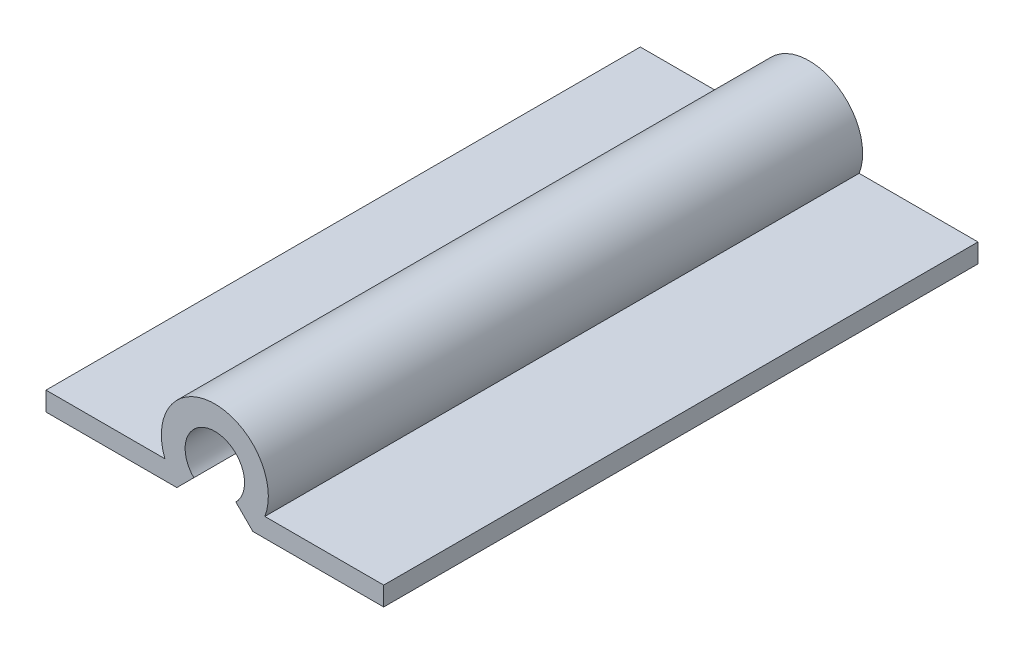
ISO-10303-21;
HEADER;
FILE_DESCRIPTION(('STEP AP214'),'2;1');
FILE_NAME('part.step','',(''),(''),'','','');
FILE_SCHEMA(('AUTOMOTIVE_DESIGN { 1 0 10303 214 1 1 1 1 }'));
ENDSEC;
DATA;
#1=APPLICATION_CONTEXT('core data for automotive mechanical design processes');
#2=APPLICATION_PROTOCOL_DEFINITION('international standard','automotive_design',2000,#1);
#3=PRODUCT_CONTEXT('',#1,'mechanical');
#4=PRODUCT('Part','Part','',(#3));
#5=PRODUCT_RELATED_PRODUCT_CATEGORY('part','',(#4));
#6=PRODUCT_DEFINITION_FORMATION('','',#4);
#7=PRODUCT_DEFINITION_CONTEXT('part definition',#1,'design');
#8=PRODUCT_DEFINITION('design','',#6,#7);
#9=PRODUCT_DEFINITION_SHAPE('','',#8);
#10=(LENGTH_UNIT() NAMED_UNIT(*) SI_UNIT(.MILLI.,.METRE.));
#11=(NAMED_UNIT(*) PLANE_ANGLE_UNIT() SI_UNIT($,.RADIAN.));
#12=(NAMED_UNIT(*) SI_UNIT($,.STERADIAN.) SOLID_ANGLE_UNIT());
#13=UNCERTAINTY_MEASURE_WITH_UNIT(LENGTH_MEASURE(1.E-05),#10,'distance_accuracy_value','');
#14=(GEOMETRIC_REPRESENTATION_CONTEXT(3) GLOBAL_UNCERTAINTY_ASSIGNED_CONTEXT((#13)) GLOBAL_UNIT_ASSIGNED_CONTEXT((#10,
#11,#12)) REPRESENTATION_CONTEXT('',''));
#15=CARTESIAN_POINT('',(0.,0.,0.));
#16=DIRECTION('',(0.,0.,1.));
#17=DIRECTION('',(1.,0.,0.));
#18=AXIS2_PLACEMENT_3D('',#15,#16,#17);
#19=CARTESIAN_POINT('',(0.,0.,31.75));
#20=DIRECTION('',(0.,0.,-1.));
#21=DIRECTION('',(-1.,0.,0.));
#22=AXIS2_PLACEMENT_3D('',#19,#20,#21);
#23=CYLINDRICAL_SURFACE('',#22,2.8575);
#24=CARTESIAN_POINT('',(0.,0.,0.));
#25=DIRECTION('',(0.,0.,1.));
#26=DIRECTION('',(1.,0.,0.));
#27=AXIS2_PLACEMENT_3D('',#24,#25,#26);
#28=CIRCLE('',#27,2.8575);
#29=CARTESIAN_POINT('',(2.67077708729126,-1.016,0.));
#30=VERTEX_POINT('',#29);
#31=CARTESIAN_POINT('',(-2.67077708729126,-1.016,0.));
#32=VERTEX_POINT('',#31);
#33=EDGE_CURVE('E142',#30,#32,#28,.T.);
#34=ORIENTED_EDGE('',*,*,#33,.T.);
#35=DIRECTION('',(0.,0.,-1.));
#36=VECTOR('',#35,1.);
#37=CARTESIAN_POINT('',(-2.67077708729126,-1.016,31.75));
#38=LINE('',#37,#36);
#39=CARTESIAN_POINT('',(-2.67077708729126,-1.016,31.75));
#40=VERTEX_POINT('',#39);
#41=EDGE_CURVE('E11',#40,#32,#38,.T.);
#42=ORIENTED_EDGE('',*,*,#41,.F.);
#43=CARTESIAN_POINT('',(0.,0.,31.75));
#44=DIRECTION('',(0.,0.,1.));
#45=DIRECTION('',(1.,0.,0.));
#46=AXIS2_PLACEMENT_3D('',#43,#44,#45);
#47=CIRCLE('',#46,2.8575);
#48=CARTESIAN_POINT('',(2.67077708729126,-1.016,31.75));
#49=VERTEX_POINT('',#48);
#50=EDGE_CURVE('E165',#49,#40,#47,.T.);
#51=ORIENTED_EDGE('',*,*,#50,.F.);
#52=DIRECTION('',(0.,0.,-1.));
#53=VECTOR('',#52,1.);
#54=CARTESIAN_POINT('',(2.67077708729126,-1.016,31.75));
#55=LINE('',#54,#53);
#56=EDGE_CURVE('E49',#49,#30,#55,.T.);
#57=ORIENTED_EDGE('',*,*,#56,.T.);
#58=EDGE_LOOP('',(#34,#42,#51,#57));
#59=FACE_BOUND('',#58,.T.);
#60=ADVANCED_FACE('F33',(#59),#23,.T.);
#61=CARTESIAN_POINT('',(-2.67077708729126,-1.016,31.75));
#62=DIRECTION('',(0.,-1.,0.));
#63=DIRECTION('',(1.,0.,0.));
#64=AXIS2_PLACEMENT_3D('',#61,#62,#63);
#65=PLANE('',#64);
#66=DIRECTION('',(-1.,0.,0.));
#67=VECTOR('',#66,1.);
#68=CARTESIAN_POINT('',(-2.67077708729126,-1.016,0.));
#69=LINE('',#68,#67);
#70=CARTESIAN_POINT('',(-9.02077708729126,-1.016,0.));
#71=VERTEX_POINT('',#70);
#72=EDGE_CURVE('E144',#32,#71,#69,.T.);
#73=ORIENTED_EDGE('',*,*,#72,.T.);
#74=DIRECTION('',(0.,0.,-1.));
#75=VECTOR('',#74,1.);
#76=CARTESIAN_POINT('',(-9.02077708729126,-1.016,31.75));
#77=LINE('',#76,#75);
#78=CARTESIAN_POINT('',(-9.02077708729126,-1.016,31.75));
#79=VERTEX_POINT('',#78);
#80=EDGE_CURVE('E41',#79,#71,#77,.T.);
#81=ORIENTED_EDGE('',*,*,#80,.F.);
#82=DIRECTION('',(-1.,0.,0.));
#83=VECTOR('',#82,1.);
#84=CARTESIAN_POINT('',(-2.67077708729126,-1.016,31.75));
#85=LINE('',#84,#83);
#86=EDGE_CURVE('E93',#40,#79,#85,.T.);
#87=ORIENTED_EDGE('',*,*,#86,.F.);
#88=ORIENTED_EDGE('',*,*,#41,.T.);
#89=EDGE_LOOP('',(#73,#81,#87,#88));
#90=FACE_BOUND('',#89,.T.);
#91=ADVANCED_FACE('F220',(#90),#65,.F.);
#92=CARTESIAN_POINT('',(-9.02077708729126,-1.016,31.75));
#93=DIRECTION('',(1.,0.,0.));
#94=DIRECTION('',(0.,0.,-1.));
#95=AXIS2_PLACEMENT_3D('',#92,#93,#94);
#96=PLANE('',#95);
#97=DIRECTION('',(0.,-1.,0.));
#98=VECTOR('',#97,1.);
#99=CARTESIAN_POINT('',(-9.02077708729126,-1.016,0.));
#100=LINE('',#99,#98);
#101=CARTESIAN_POINT('',(-9.02077708729126,-2.032,0.));
#102=VERTEX_POINT('',#101);
#103=EDGE_CURVE('E146',#71,#102,#100,.T.);
#104=ORIENTED_EDGE('',*,*,#103,.T.);
#105=DIRECTION('',(0.,0.,-1.));
#106=VECTOR('',#105,1.);
#107=CARTESIAN_POINT('',(-9.02077708729126,-2.032,31.75));
#108=LINE('',#107,#106);
#109=CARTESIAN_POINT('',(-9.02077708729126,-2.032,31.75));
#110=VERTEX_POINT('',#109);
#111=EDGE_CURVE('E176',#110,#102,#108,.T.);
#112=ORIENTED_EDGE('',*,*,#111,.F.);
#113=DIRECTION('',(0.,-1.,0.));
#114=VECTOR('',#113,1.);
#115=CARTESIAN_POINT('',(-9.02077708729126,-1.016,31.75));
#116=LINE('',#115,#114);
#117=EDGE_CURVE('E184',#79,#110,#116,.T.);
#118=ORIENTED_EDGE('',*,*,#117,.F.);
#119=ORIENTED_EDGE('',*,*,#80,.T.);
#120=EDGE_LOOP('',(#104,#112,#118,#119));
#121=FACE_BOUND('',#120,.T.);
#122=ADVANCED_FACE('F182',(#121),#96,.F.);
#123=CARTESIAN_POINT('',(-9.02077708729126,-2.032,31.75));
#124=DIRECTION('',(0.,1.,0.));
#125=DIRECTION('',(-1.,0.,0.));
#126=AXIS2_PLACEMENT_3D('',#123,#124,#125);
#127=PLANE('',#126);
#128=DIRECTION('',(1.,0.,0.));
#129=VECTOR('',#128,1.);
#130=CARTESIAN_POINT('',(-9.02077708729126,-2.032,0.));
#131=LINE('',#130,#129);
#132=CARTESIAN_POINT('',(-2.03199999999999,-2.032,0.));
#133=VERTEX_POINT('',#132);
#134=EDGE_CURVE('E148',#102,#133,#131,.T.);
#135=ORIENTED_EDGE('',*,*,#134,.T.);
#136=DIRECTION('',(0.,0.,-1.));
#137=VECTOR('',#136,1.);
#138=CARTESIAN_POINT('',(-2.03199999999999,-2.032,31.75));
#139=LINE('',#138,#137);
#140=CARTESIAN_POINT('',(-2.03199999999999,-2.032,31.75));
#141=VERTEX_POINT('',#140);
#142=EDGE_CURVE('E173',#141,#133,#139,.T.);
#143=ORIENTED_EDGE('',*,*,#142,.F.);
#144=DIRECTION('',(1.,0.,0.));
#145=VECTOR('',#144,1.);
#146=CARTESIAN_POINT('',(-9.02077708729126,-2.032,31.75));
#147=LINE('',#146,#145);
#148=EDGE_CURVE('E200',#110,#141,#147,.T.);
#149=ORIENTED_EDGE('',*,*,#148,.F.);
#150=ORIENTED_EDGE('',*,*,#111,.T.);
#151=EDGE_LOOP('',(#135,#143,#149,#150));
#152=FACE_BOUND('',#151,.T.);
#153=ADVANCED_FACE('F191',(#152),#127,.F.);
#154=CARTESIAN_POINT('',(-2.03199999999999,-2.032,31.75));
#155=DIRECTION('',(-0.70710678118655,0.707106781186545,0.));
#156=DIRECTION('',(-0.707106781186545,-0.70710678118655,0.));
#157=AXIS2_PLACEMENT_3D('',#154,#155,#156);
#158=PLANE('',#157);
#159=DIRECTION('',(0.707106781186545,0.707106781186549,0.));
#160=VECTOR('',#159,1.);
#161=CARTESIAN_POINT('',(-2.03199999999999,-2.032,0.));
#162=LINE('',#161,#160);
#163=CARTESIAN_POINT('',(-1.12253201513364,-1.12253201513365,0.));
#164=VERTEX_POINT('',#163);
#165=EDGE_CURVE('E150',#133,#164,#162,.T.);
#166=ORIENTED_EDGE('',*,*,#165,.T.);
#167=DIRECTION('',(0.,0.,-1.));
#168=VECTOR('',#167,1.);
#169=CARTESIAN_POINT('',(-1.12253201513364,-1.12253201513365,31.75));
#170=LINE('',#169,#168);
#171=CARTESIAN_POINT('',(-1.12253201513364,-1.12253201513365,31.75));
#172=VERTEX_POINT('',#171);
#173=EDGE_CURVE('E171',#172,#164,#170,.T.);
#174=ORIENTED_EDGE('',*,*,#173,.F.);
#175=DIRECTION('',(0.707106781186545,0.707106781186549,0.));
#176=VECTOR('',#175,1.);
#177=CARTESIAN_POINT('',(-2.03199999999999,-2.032,31.75));
#178=LINE('',#177,#176);
#179=EDGE_CURVE('E197',#141,#172,#178,.T.);
#180=ORIENTED_EDGE('',*,*,#179,.F.);
#181=ORIENTED_EDGE('',*,*,#142,.T.);
#182=EDGE_LOOP('',(#166,#174,#180,#181));
#183=FACE_BOUND('',#182,.T.);
#184=ADVANCED_FACE('F195',(#183),#158,.F.);
#185=CARTESIAN_POINT('',(0.,0.,31.75));
#186=DIRECTION('',(0.,0.,-1.));
#187=DIRECTION('',(-1.,0.,0.));
#188=AXIS2_PLACEMENT_3D('',#185,#186,#187);
#189=CYLINDRICAL_SURFACE('',#188,1.5875);
#190=CARTESIAN_POINT('',(0.,0.,0.));
#191=DIRECTION('',(0.,0.,1.));
#192=DIRECTION('',(1.,0.,0.));
#193=AXIS2_PLACEMENT_3D('',#190,#191,#192);
#194=CIRCLE('',#193,1.5875);
#195=CARTESIAN_POINT('',(1.12253201513365,-1.12253201513364,0.));
#196=VERTEX_POINT('',#195);
#197=EDGE_CURVE('E153',#196,#164,#194,.T.);
#198=ORIENTED_EDGE('',*,*,#197,.F.);
#199=DIRECTION('',(0.,0.,-1.));
#200=VECTOR('',#199,1.);
#201=CARTESIAN_POINT('',(1.12253201513365,-1.12253201513364,31.75));
#202=LINE('',#201,#200);
#203=CARTESIAN_POINT('',(1.12253201513365,-1.12253201513364,31.75));
#204=VERTEX_POINT('',#203);
#205=EDGE_CURVE('E169',#204,#196,#202,.T.);
#206=ORIENTED_EDGE('',*,*,#205,.F.);
#207=CARTESIAN_POINT('',(0.,0.,31.75));
#208=DIRECTION('',(0.,0.,1.));
#209=DIRECTION('',(1.,0.,0.));
#210=AXIS2_PLACEMENT_3D('',#207,#208,#209);
#211=CIRCLE('',#210,1.5875);
#212=EDGE_CURVE('E199',#204,#172,#211,.T.);
#213=ORIENTED_EDGE('',*,*,#212,.T.);
#214=ORIENTED_EDGE('',*,*,#173,.T.);
#215=EDGE_LOOP('',(#198,#206,#213,#214));
#216=FACE_BOUND('',#215,.T.);
#217=ADVANCED_FACE('F236',(#216),#189,.F.);
#218=CARTESIAN_POINT('',(2.03200000000002,-2.032,31.75));
#219=DIRECTION('',(-0.707106781186544,-0.707106781186551,0.));
#220=DIRECTION('',(0.707106781186551,-0.707106781186544,0.));
#221=AXIS2_PLACEMENT_3D('',#218,#219,#220);
#222=PLANE('',#221);
#223=DIRECTION('',(-0.707106781186551,0.707106781186544,0.));
#224=VECTOR('',#223,1.);
#225=CARTESIAN_POINT('',(2.03200000000002,-2.032,0.));
#226=LINE('',#225,#224);
#227=CARTESIAN_POINT('',(2.03200000000002,-2.032,0.));
#228=VERTEX_POINT('',#227);
#229=EDGE_CURVE('E156',#228,#196,#226,.T.);
#230=ORIENTED_EDGE('',*,*,#229,.F.);
#231=DIRECTION('',(0.,0.,-1.));
#232=VECTOR('',#231,1.);
#233=CARTESIAN_POINT('',(2.03200000000002,-2.032,31.75));
#234=LINE('',#233,#232);
#235=CARTESIAN_POINT('',(2.03200000000002,-2.032,31.75));
#236=VERTEX_POINT('',#235);
#237=EDGE_CURVE('E134',#236,#228,#234,.T.);
#238=ORIENTED_EDGE('',*,*,#237,.F.);
#239=DIRECTION('',(-0.707106781186551,0.707106781186544,0.));
#240=VECTOR('',#239,1.);
#241=CARTESIAN_POINT('',(2.03200000000002,-2.032,31.75));
#242=LINE('',#241,#240);
#243=EDGE_CURVE('E124',#236,#204,#242,.T.);
#244=ORIENTED_EDGE('',*,*,#243,.T.);
#245=ORIENTED_EDGE('',*,*,#205,.T.);
#246=EDGE_LOOP('',(#230,#238,#244,#245));
#247=FACE_BOUND('',#246,.T.);
#248=ADVANCED_FACE('F207',(#247),#222,.T.);
#249=CARTESIAN_POINT('',(2.03200000000002,-2.032,31.75));
#250=DIRECTION('',(0.,1.,0.));
#251=DIRECTION('',(-1.,0.,0.));
#252=AXIS2_PLACEMENT_3D('',#249,#250,#251);
#253=PLANE('',#252);
#254=DIRECTION('',(1.,0.,0.));
#255=VECTOR('',#254,1.);
#256=CARTESIAN_POINT('',(2.03200000000002,-2.032,0.));
#257=LINE('',#256,#255);
#258=CARTESIAN_POINT('',(9.02077708729129,-2.032,0.));
#259=VERTEX_POINT('',#258);
#260=EDGE_CURVE('E131',#228,#259,#257,.T.);
#261=ORIENTED_EDGE('',*,*,#260,.T.);
#262=DIRECTION('',(0.,0.,-1.));
#263=VECTOR('',#262,1.);
#264=CARTESIAN_POINT('',(9.02077708729129,-2.032,31.75));
#265=LINE('',#264,#263);
#266=CARTESIAN_POINT('',(9.02077708729129,-2.032,31.75));
#267=VERTEX_POINT('',#266);
#268=EDGE_CURVE('E128',#267,#259,#265,.T.);
#269=ORIENTED_EDGE('',*,*,#268,.F.);
#270=DIRECTION('',(1.,0.,0.));
#271=VECTOR('',#270,1.);
#272=CARTESIAN_POINT('',(2.03200000000002,-2.032,31.75));
#273=LINE('',#272,#271);
#274=EDGE_CURVE('E116',#236,#267,#273,.T.);
#275=ORIENTED_EDGE('',*,*,#274,.F.);
#276=ORIENTED_EDGE('',*,*,#237,.T.);
#277=EDGE_LOOP('',(#261,#269,#275,#276));
#278=FACE_BOUND('',#277,.T.);
#279=ADVANCED_FACE('F129',(#278),#253,.F.);
#280=CARTESIAN_POINT('',(9.02077708729126,-1.016,31.75));
#281=DIRECTION('',(1.,0.,0.));
#282=DIRECTION('',(0.,1.,0.));
#283=AXIS2_PLACEMENT_3D('',#280,#281,#282);
#284=PLANE('',#283);
#285=DIRECTION('',(0.,-1.,0.));
#286=VECTOR('',#285,1.);
#287=CARTESIAN_POINT('',(9.02077708729126,-1.016,0.));
#288=LINE('',#287,#286);
#289=CARTESIAN_POINT('',(9.02077708729126,-1.016,0.));
#290=VERTEX_POINT('',#289);
#291=EDGE_CURVE('E160',#290,#259,#288,.T.);
#292=ORIENTED_EDGE('',*,*,#291,.F.);
#293=DIRECTION('',(0.,0.,-1.));
#294=VECTOR('',#293,1.);
#295=CARTESIAN_POINT('',(9.02077708729126,-1.016,31.75));
#296=LINE('',#295,#294);
#297=CARTESIAN_POINT('',(9.02077708729126,-1.016,31.75));
#298=VERTEX_POINT('',#297);
#299=EDGE_CURVE('E81',#298,#290,#296,.T.);
#300=ORIENTED_EDGE('',*,*,#299,.F.);
#301=DIRECTION('',(0.,-1.,0.));
#302=VECTOR('',#301,1.);
#303=CARTESIAN_POINT('',(9.02077708729126,-1.016,31.75));
#304=LINE('',#303,#302);
#305=EDGE_CURVE('E121',#298,#267,#304,.T.);
#306=ORIENTED_EDGE('',*,*,#305,.T.);
#307=ORIENTED_EDGE('',*,*,#268,.T.);
#308=EDGE_LOOP('',(#292,#300,#306,#307));
#309=FACE_BOUND('',#308,.T.);
#310=ADVANCED_FACE('F136',(#309),#284,.T.);
#311=CARTESIAN_POINT('',(2.67077708729126,-1.016,31.75));
#312=DIRECTION('',(0.,1.,0.));
#313=DIRECTION('',(-1.,0.,0.));
#314=AXIS2_PLACEMENT_3D('',#311,#312,#313);
#315=PLANE('',#314);
#316=DIRECTION('',(1.,0.,0.));
#317=VECTOR('',#316,1.);
#318=CARTESIAN_POINT('',(2.67077708729126,-1.016,0.));
#319=LINE('',#318,#317);
#320=EDGE_CURVE('E162',#30,#290,#319,.T.);
#321=ORIENTED_EDGE('',*,*,#320,.F.);
#322=ORIENTED_EDGE('',*,*,#56,.F.);
#323=DIRECTION('',(1.,0.,0.));
#324=VECTOR('',#323,1.);
#325=CARTESIAN_POINT('',(2.67077708729126,-1.016,31.75));
#326=LINE('',#325,#324);
#327=EDGE_CURVE('E137',#49,#298,#326,.T.);
#328=ORIENTED_EDGE('',*,*,#327,.T.);
#329=ORIENTED_EDGE('',*,*,#299,.T.);
#330=EDGE_LOOP('',(#321,#322,#328,#329));
#331=FACE_BOUND('',#330,.T.);
#332=ADVANCED_FACE('F209',(#331),#315,.T.);
#333=CARTESIAN_POINT('',(0.,0.,31.75));
#334=DIRECTION('',(0.,0.,1.));
#335=DIRECTION('',(1.,0.,0.));
#336=AXIS2_PLACEMENT_3D('',#333,#334,#335);
#337=PLANE('',#336);
#338=ORIENTED_EDGE('',*,*,#50,.T.);
#339=ORIENTED_EDGE('',*,*,#86,.T.);
#340=ORIENTED_EDGE('',*,*,#117,.T.);
#341=ORIENTED_EDGE('',*,*,#148,.T.);
#342=ORIENTED_EDGE('',*,*,#179,.T.);
#343=ORIENTED_EDGE('',*,*,#212,.F.);
#344=ORIENTED_EDGE('',*,*,#243,.F.);
#345=ORIENTED_EDGE('',*,*,#274,.T.);
#346=ORIENTED_EDGE('',*,*,#305,.F.);
#347=ORIENTED_EDGE('',*,*,#327,.F.);
#348=EDGE_LOOP('',(#338,#339,#340,#341,#342,#343,#344,#345,#346,#347));
#349=FACE_BOUND('',#348,.T.);
#350=ADVANCED_FACE('F118',(#349),#337,.T.);
#351=CARTESIAN_POINT('',(0.,0.,0.));
#352=DIRECTION('',(0.,0.,1.));
#353=DIRECTION('',(1.,0.,0.));
#354=AXIS2_PLACEMENT_3D('',#351,#352,#353);
#355=PLANE('',#354);
#356=ORIENTED_EDGE('',*,*,#33,.F.);
#357=ORIENTED_EDGE('',*,*,#320,.T.);
#358=ORIENTED_EDGE('',*,*,#291,.T.);
#359=ORIENTED_EDGE('',*,*,#260,.F.);
#360=ORIENTED_EDGE('',*,*,#229,.T.);
#361=ORIENTED_EDGE('',*,*,#197,.T.);
#362=ORIENTED_EDGE('',*,*,#165,.F.);
#363=ORIENTED_EDGE('',*,*,#134,.F.);
#364=ORIENTED_EDGE('',*,*,#103,.F.);
#365=ORIENTED_EDGE('',*,*,#72,.F.);
#366=EDGE_LOOP('',(#356,#357,#358,#359,#360,#361,#362,#363,#364,#365));
#367=FACE_BOUND('',#366,.T.);
#368=ADVANCED_FACE('F187',(#367),#355,.F.);
#369=CLOSED_SHELL('',(#60,#91,#122,#153,#184,#217,#248,#279,#310,#332,#350,#368));
#370=MANIFOLD_SOLID_BREP('B2',#369);
#371=ADVANCED_BREP_SHAPE_REPRESENTATION('',(#18,#370),#14);
#372=SHAPE_DEFINITION_REPRESENTATION(#9,#371);
ENDSEC;
END-ISO-10303-21;
